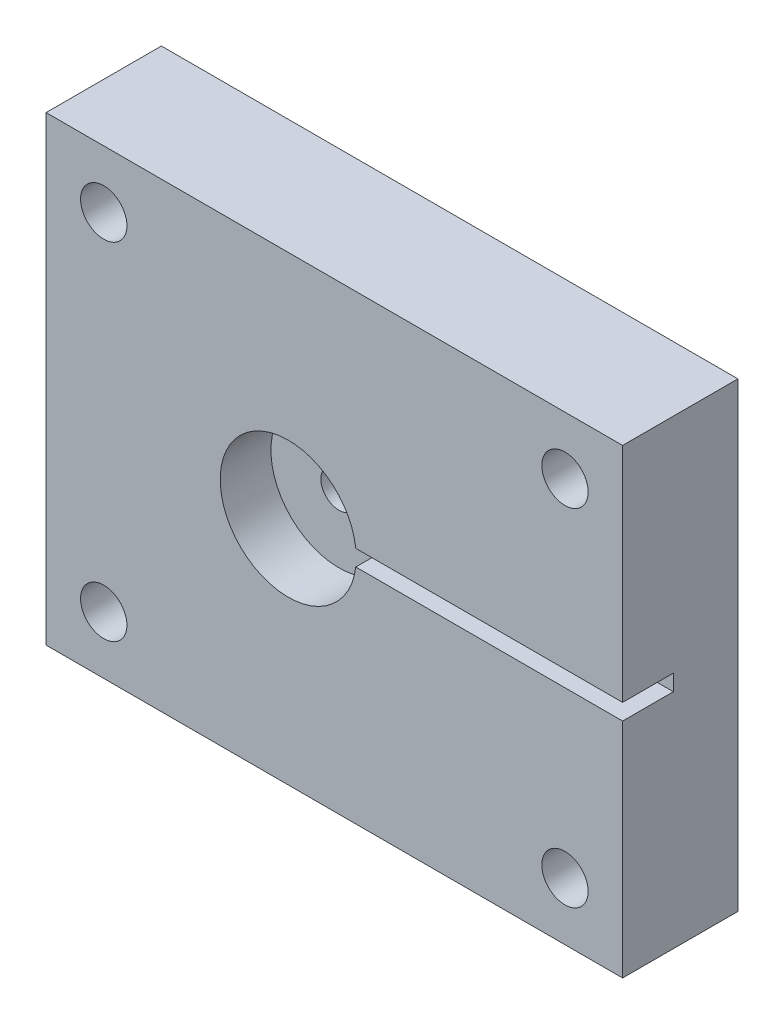
ISO-10303-21;
HEADER;
FILE_DESCRIPTION(('STEP AP214'),'2;1');
FILE_NAME('part.step','',(''),(''),'','','');
FILE_SCHEMA(('AUTOMOTIVE_DESIGN { 1 0 10303 214 1 1 1 1 }'));
ENDSEC;
DATA;
#1=APPLICATION_CONTEXT('core data for automotive mechanical design processes');
#2=APPLICATION_PROTOCOL_DEFINITION('international standard','automotive_design',2000,#1);
#3=PRODUCT_CONTEXT('',#1,'mechanical');
#4=PRODUCT('Part','Part','',(#3));
#5=PRODUCT_RELATED_PRODUCT_CATEGORY('part','',(#4));
#6=PRODUCT_DEFINITION_FORMATION('','',#4);
#7=PRODUCT_DEFINITION_CONTEXT('part definition',#1,'design');
#8=PRODUCT_DEFINITION('design','',#6,#7);
#9=PRODUCT_DEFINITION_SHAPE('','',#8);
#10=(LENGTH_UNIT() NAMED_UNIT(*) SI_UNIT(.MILLI.,.METRE.));
#11=(NAMED_UNIT(*) PLANE_ANGLE_UNIT() SI_UNIT($,.RADIAN.));
#12=(NAMED_UNIT(*) SI_UNIT($,.STERADIAN.) SOLID_ANGLE_UNIT());
#13=UNCERTAINTY_MEASURE_WITH_UNIT(LENGTH_MEASURE(1.E-05),#10,'distance_accuracy_value','');
#14=(GEOMETRIC_REPRESENTATION_CONTEXT(3) GLOBAL_UNCERTAINTY_ASSIGNED_CONTEXT((#13)) GLOBAL_UNIT_ASSIGNED_CONTEXT((#10,
#11,#12)) REPRESENTATION_CONTEXT('',''));
#15=CARTESIAN_POINT('',(0.,0.,0.));
#16=DIRECTION('',(0.,0.,1.));
#17=DIRECTION('',(1.,0.,0.));
#18=AXIS2_PLACEMENT_3D('',#15,#16,#17);
#19=CARTESIAN_POINT('',(-5.08,0.,-4.8768));
#20=DIRECTION('',(0.,0.,1.));
#21=DIRECTION('',(1.,0.,0.));
#22=AXIS2_PLACEMENT_3D('',#19,#20,#21);
#23=CYLINDRICAL_SURFACE('',#22,1.9939);
#24=CARTESIAN_POINT('',(-5.08,0.,7.112));
#25=DIRECTION('',(0.,0.,1.));
#26=DIRECTION('',(1.,0.,0.));
#27=AXIS2_PLACEMENT_3D('',#24,#25,#26);
#28=CIRCLE('',#27,1.9939);
#29=CARTESIAN_POINT('',(-3.0861,0.,7.112));
#30=VERTEX_POINT('',#29);
#31=EDGE_CURVE('E167',#30,#30,#28,.T.);
#32=ORIENTED_EDGE('',*,*,#31,.T.);
#33=EDGE_LOOP('',(#32));
#34=FACE_BOUND('',#33,.T.);
#35=CARTESIAN_POINT('',(-5.08,0.,4.572));
#36=DIRECTION('',(0.,0.,-1.));
#37=DIRECTION('',(-1.,0.,0.));
#38=AXIS2_PLACEMENT_3D('',#35,#36,#37);
#39=CIRCLE('',#38,1.9939);
#40=CARTESIAN_POINT('',(-7.0739,0.,4.572));
#41=VERTEX_POINT('',#40);
#42=EDGE_CURVE('E38',#41,#41,#39,.F.);
#43=ORIENTED_EDGE('',*,*,#42,.F.);
#44=EDGE_LOOP('',(#43));
#45=FACE_BOUND('',#44,.T.);
#46=ADVANCED_FACE('F34',(#34,#45),#23,.F.);
#47=CARTESIAN_POINT('',(31.75,25.4,12.7));
#48=DIRECTION('',(-1.,0.,0.));
#49=DIRECTION('',(0.,-1.,0.));
#50=AXIS2_PLACEMENT_3D('',#47,#48,#49);
#51=PLANE('',#50);
#52=DIRECTION('',(0.,1.,0.));
#53=VECTOR('',#52,1.);
#54=CARTESIAN_POINT('',(31.75,0.88900000000001,7.112));
#55=LINE('',#54,#53);
#56=CARTESIAN_POINT('',(31.75,-0.88899999999999,7.112));
#57=VERTEX_POINT('',#56);
#58=CARTESIAN_POINT('',(31.75,0.88900000000001,7.112));
#59=VERTEX_POINT('',#58);
#60=EDGE_CURVE('E114',#57,#59,#55,.T.);
#61=ORIENTED_EDGE('',*,*,#60,.F.);
#62=DIRECTION('',(0.,0.,1.));
#63=VECTOR('',#62,1.);
#64=CARTESIAN_POINT('',(31.75,-0.88899999999999,-24.6877450304244));
#65=LINE('',#64,#63);
#66=CARTESIAN_POINT('',(31.75,-0.88899999999999,12.7));
#67=VERTEX_POINT('',#66);
#68=EDGE_CURVE('E119',#57,#67,#65,.T.);
#69=ORIENTED_EDGE('',*,*,#68,.T.);
#70=DIRECTION('',(0.,1.,0.));
#71=VECTOR('',#70,1.);
#72=CARTESIAN_POINT('',(31.75,25.4,12.7));
#73=LINE('',#72,#71);
#74=CARTESIAN_POINT('',(31.75,-25.4,12.7));
#75=VERTEX_POINT('',#74);
#76=EDGE_CURVE('E139',#75,#67,#73,.T.);
#77=ORIENTED_EDGE('',*,*,#76,.F.);
#78=DIRECTION('',(0.,0.,-1.));
#79=VECTOR('',#78,1.);
#80=CARTESIAN_POINT('',(31.75,-25.4,12.7));
#81=LINE('',#80,#79);
#82=CARTESIAN_POINT('',(31.75,-25.4,0.));
#83=VERTEX_POINT('',#82);
#84=EDGE_CURVE('E146',#75,#83,#81,.T.);
#85=ORIENTED_EDGE('',*,*,#84,.T.);
#86=DIRECTION('',(0.,1.,0.));
#87=VECTOR('',#86,1.);
#88=CARTESIAN_POINT('',(31.75,25.4,0.));
#89=LINE('',#88,#87);
#90=CARTESIAN_POINT('',(31.75,25.4,0.));
#91=VERTEX_POINT('',#90);
#92=EDGE_CURVE('E138',#83,#91,#89,.T.);
#93=ORIENTED_EDGE('',*,*,#92,.T.);
#94=DIRECTION('',(0.,0.,-1.));
#95=VECTOR('',#94,1.);
#96=CARTESIAN_POINT('',(31.75,25.4,12.7));
#97=LINE('',#96,#95);
#98=CARTESIAN_POINT('',(31.75,25.4,12.7));
#99=VERTEX_POINT('',#98);
#100=EDGE_CURVE('E160',#99,#91,#97,.T.);
#101=ORIENTED_EDGE('',*,*,#100,.F.);
#102=CARTESIAN_POINT('',(31.75,0.88900000000001,12.7));
#103=VERTEX_POINT('',#102);
#104=EDGE_CURVE('E86',#103,#99,#73,.T.);
#105=ORIENTED_EDGE('',*,*,#104,.F.);
#106=DIRECTION('',(0.,0.,1.));
#107=VECTOR('',#106,1.);
#108=CARTESIAN_POINT('',(31.75,0.88900000000001,-24.6877450304244));
#109=LINE('',#108,#107);
#110=EDGE_CURVE('E128',#59,#103,#109,.T.);
#111=ORIENTED_EDGE('',*,*,#110,.F.);
#112=EDGE_LOOP('',(#61,#69,#77,#85,#93,#101,#105,#111));
#113=FACE_BOUND('',#112,.T.);
#114=ADVANCED_FACE('F36',(#113),#51,.F.);
#115=CARTESIAN_POINT('',(-31.75,25.4,12.7));
#116=DIRECTION('',(0.,-1.,0.));
#117=DIRECTION('',(0.,0.,-1.));
#118=AXIS2_PLACEMENT_3D('',#115,#116,#117);
#119=PLANE('',#118);
#120=DIRECTION('',(-1.,0.,0.));
#121=VECTOR('',#120,1.);
#122=CARTESIAN_POINT('',(-31.75,25.4,0.));
#123=LINE('',#122,#121);
#124=CARTESIAN_POINT('',(-31.75,25.4,0.));
#125=VERTEX_POINT('',#124);
#126=EDGE_CURVE('E149',#91,#125,#123,.T.);
#127=ORIENTED_EDGE('',*,*,#126,.T.);
#128=DIRECTION('',(0.,0.,-1.));
#129=VECTOR('',#128,1.);
#130=CARTESIAN_POINT('',(-31.75,25.4,12.7));
#131=LINE('',#130,#129);
#132=CARTESIAN_POINT('',(-31.75,25.4,12.7));
#133=VERTEX_POINT('',#132);
#134=EDGE_CURVE('E157',#133,#125,#131,.T.);
#135=ORIENTED_EDGE('',*,*,#134,.F.);
#136=DIRECTION('',(-1.,0.,0.));
#137=VECTOR('',#136,1.);
#138=CARTESIAN_POINT('',(-31.75,25.4,12.7));
#139=LINE('',#138,#137);
#140=EDGE_CURVE('E141',#99,#133,#139,.T.);
#141=ORIENTED_EDGE('',*,*,#140,.F.);
#142=ORIENTED_EDGE('',*,*,#100,.T.);
#143=EDGE_LOOP('',(#127,#135,#141,#142));
#144=FACE_BOUND('',#143,.T.);
#145=ADVANCED_FACE('F229',(#144),#119,.F.);
#146=CARTESIAN_POINT('',(-31.75,25.4,12.7));
#147=DIRECTION('',(1.,0.,0.));
#148=DIRECTION('',(0.,1.,0.));
#149=AXIS2_PLACEMENT_3D('',#146,#147,#148);
#150=PLANE('',#149);
#151=DIRECTION('',(0.,-1.,0.));
#152=VECTOR('',#151,1.);
#153=CARTESIAN_POINT('',(-31.75,25.4,0.));
#154=LINE('',#153,#152);
#155=CARTESIAN_POINT('',(-31.75,-25.4,0.));
#156=VERTEX_POINT('',#155);
#157=EDGE_CURVE('E151',#125,#156,#154,.T.);
#158=ORIENTED_EDGE('',*,*,#157,.T.);
#159=DIRECTION('',(0.,0.,-1.));
#160=VECTOR('',#159,1.);
#161=CARTESIAN_POINT('',(-31.75,-25.4,12.7));
#162=LINE('',#161,#160);
#163=CARTESIAN_POINT('',(-31.75,-25.4,12.7));
#164=VERTEX_POINT('',#163);
#165=EDGE_CURVE('E155',#164,#156,#162,.T.);
#166=ORIENTED_EDGE('',*,*,#165,.F.);
#167=DIRECTION('',(0.,-1.,0.));
#168=VECTOR('',#167,1.);
#169=CARTESIAN_POINT('',(-31.75,25.4,12.7));
#170=LINE('',#169,#168);
#171=EDGE_CURVE('E143',#133,#164,#170,.T.);
#172=ORIENTED_EDGE('',*,*,#171,.F.);
#173=ORIENTED_EDGE('',*,*,#134,.T.);
#174=EDGE_LOOP('',(#158,#166,#172,#173));
#175=FACE_BOUND('',#174,.T.);
#176=ADVANCED_FACE('F226',(#175),#150,.F.);
#177=CARTESIAN_POINT('',(-31.75,-25.4,12.7));
#178=DIRECTION('',(0.,1.,0.));
#179=DIRECTION('',(0.,0.,1.));
#180=AXIS2_PLACEMENT_3D('',#177,#178,#179);
#181=PLANE('',#180);
#182=DIRECTION('',(1.,0.,0.));
#183=VECTOR('',#182,1.);
#184=CARTESIAN_POINT('',(-31.75,-25.4,0.));
#185=LINE('',#184,#183);
#186=EDGE_CURVE('E80',#156,#83,#185,.T.);
#187=ORIENTED_EDGE('',*,*,#186,.T.);
#188=ORIENTED_EDGE('',*,*,#84,.F.);
#189=DIRECTION('',(1.,0.,0.));
#190=VECTOR('',#189,1.);
#191=CARTESIAN_POINT('',(-31.75,-25.4,12.7));
#192=LINE('',#191,#190);
#193=EDGE_CURVE('E59',#164,#75,#192,.T.);
#194=ORIENTED_EDGE('',*,*,#193,.F.);
#195=ORIENTED_EDGE('',*,*,#165,.T.);
#196=EDGE_LOOP('',(#187,#188,#194,#195));
#197=FACE_BOUND('',#196,.T.);
#198=ADVANCED_FACE('F222',(#197),#181,.F.);
#199=CARTESIAN_POINT('',(0.,0.,12.7));
#200=DIRECTION('',(0.,0.,1.));
#201=DIRECTION('',(1.,0.,0.));
#202=AXIS2_PLACEMENT_3D('',#199,#200,#201);
#203=PLANE('',#202);
#204=CARTESIAN_POINT('',(-25.4,-19.05,12.7));
#205=DIRECTION('',(0.,0.,-1.));
#206=DIRECTION('',(1.,0.,0.));
#207=AXIS2_PLACEMENT_3D('',#204,#205,#206);
#208=CIRCLE('',#207,2.5527);
#209=CARTESIAN_POINT('',(-22.8473,-19.05,12.7));
#210=VERTEX_POINT('',#209);
#211=EDGE_CURVE('E198',#210,#210,#208,.T.);
#212=ORIENTED_EDGE('',*,*,#211,.T.);
#213=EDGE_LOOP('',(#212));
#214=FACE_BOUND('',#213,.T.);
#215=CARTESIAN_POINT('',(25.4,-19.05,12.7));
#216=DIRECTION('',(0.,0.,1.));
#217=DIRECTION('',(-1.,0.,0.));
#218=AXIS2_PLACEMENT_3D('',#215,#216,#217);
#219=CIRCLE('',#218,2.5527);
#220=CARTESIAN_POINT('',(22.8473,-19.05,12.7));
#221=VERTEX_POINT('',#220);
#222=EDGE_CURVE('E192',#221,#221,#219,.T.);
#223=ORIENTED_EDGE('',*,*,#222,.F.);
#224=EDGE_LOOP('',(#223));
#225=FACE_BOUND('',#224,.T.);
#226=CARTESIAN_POINT('',(25.4,19.05,12.7));
#227=DIRECTION('',(0.,0.,-1.));
#228=DIRECTION('',(-1.,0.,0.));
#229=AXIS2_PLACEMENT_3D('',#226,#227,#228);
#230=CIRCLE('',#229,2.5527);
#231=CARTESIAN_POINT('',(22.8473,19.05,12.7));
#232=VERTEX_POINT('',#231);
#233=EDGE_CURVE('E186',#232,#232,#230,.T.);
#234=ORIENTED_EDGE('',*,*,#233,.T.);
#235=EDGE_LOOP('',(#234));
#236=FACE_BOUND('',#235,.T.);
#237=CARTESIAN_POINT('',(-25.4,19.05,12.7));
#238=DIRECTION('',(0.,0.,1.));
#239=DIRECTION('',(1.,0.,0.));
#240=AXIS2_PLACEMENT_3D('',#237,#238,#239);
#241=CIRCLE('',#240,2.5527);
#242=CARTESIAN_POINT('',(-22.8473,19.05,12.7));
#243=VERTEX_POINT('',#242);
#244=EDGE_CURVE('E180',#243,#243,#241,.T.);
#245=ORIENTED_EDGE('',*,*,#244,.F.);
#246=EDGE_LOOP('',(#245));
#247=FACE_BOUND('',#246,.T.);
#248=DIRECTION('',(1.,0.,0.));
#249=VECTOR('',#248,1.);
#250=CARTESIAN_POINT('',(0.,-0.888999999999994,12.7));
#251=LINE('',#250,#249);
#252=CARTESIAN_POINT('',(2.36007580606542,-0.888999999999994,12.7));
#253=VERTEX_POINT('',#252);
#254=EDGE_CURVE('E124',#253,#67,#251,.T.);
#255=ORIENTED_EDGE('',*,*,#254,.F.);
#256=CARTESIAN_POINT('',(-5.08,0.,12.7));
#257=DIRECTION('',(0.,0.,1.));
#258=DIRECTION('',(1.,0.,0.));
#259=AXIS2_PLACEMENT_3D('',#256,#257,#258);
#260=CIRCLE('',#259,7.493);
#261=CARTESIAN_POINT('',(2.36007580606542,0.888999999999996,12.7));
#262=VERTEX_POINT('',#261);
#263=EDGE_CURVE('E134',#262,#253,#260,.T.);
#264=ORIENTED_EDGE('',*,*,#263,.F.);
#265=DIRECTION('',(-1.,0.,0.));
#266=VECTOR('',#265,1.);
#267=CARTESIAN_POINT('',(0.,0.888999999999994,12.7));
#268=LINE('',#267,#266);
#269=EDGE_CURVE('E50',#103,#262,#268,.T.);
#270=ORIENTED_EDGE('',*,*,#269,.F.);
#271=ORIENTED_EDGE('',*,*,#104,.T.);
#272=ORIENTED_EDGE('',*,*,#140,.T.);
#273=ORIENTED_EDGE('',*,*,#171,.T.);
#274=ORIENTED_EDGE('',*,*,#193,.T.);
#275=ORIENTED_EDGE('',*,*,#76,.T.);
#276=EDGE_LOOP('',(#255,#264,#270,#271,#272,#273,#274,#275));
#277=FACE_BOUND('',#276,.T.);
#278=ADVANCED_FACE('F166',(#214,#225,#236,#247,#277),#203,.T.);
#279=CARTESIAN_POINT('',(0.,0.,0.));
#280=DIRECTION('',(0.,0.,1.));
#281=DIRECTION('',(1.,0.,0.));
#282=AXIS2_PLACEMENT_3D('',#279,#280,#281);
#283=PLANE('',#282);
#284=CARTESIAN_POINT('',(-25.4,-19.05,0.));
#285=DIRECTION('',(0.,0.,-1.));
#286=DIRECTION('',(1.,0.,0.));
#287=AXIS2_PLACEMENT_3D('',#284,#285,#286);
#288=CIRCLE('',#287,2.5527);
#289=CARTESIAN_POINT('',(-22.8473,-19.05,0.));
#290=VERTEX_POINT('',#289);
#291=EDGE_CURVE('E195',#290,#290,#288,.T.);
#292=ORIENTED_EDGE('',*,*,#291,.F.);
#293=EDGE_LOOP('',(#292));
#294=FACE_BOUND('',#293,.T.);
#295=CARTESIAN_POINT('',(25.4,-19.05,0.));
#296=DIRECTION('',(0.,0.,1.));
#297=DIRECTION('',(-1.,0.,0.));
#298=AXIS2_PLACEMENT_3D('',#295,#296,#297);
#299=CIRCLE('',#298,2.5527);
#300=CARTESIAN_POINT('',(22.8473,-19.05,0.));
#301=VERTEX_POINT('',#300);
#302=EDGE_CURVE('E189',#301,#301,#299,.T.);
#303=ORIENTED_EDGE('',*,*,#302,.T.);
#304=EDGE_LOOP('',(#303));
#305=FACE_BOUND('',#304,.T.);
#306=CARTESIAN_POINT('',(25.4,19.05,0.));
#307=DIRECTION('',(0.,0.,-1.));
#308=DIRECTION('',(-1.,0.,0.));
#309=AXIS2_PLACEMENT_3D('',#306,#307,#308);
#310=CIRCLE('',#309,2.5527);
#311=CARTESIAN_POINT('',(22.8473,19.05,0.));
#312=VERTEX_POINT('',#311);
#313=EDGE_CURVE('E183',#312,#312,#310,.T.);
#314=ORIENTED_EDGE('',*,*,#313,.F.);
#315=EDGE_LOOP('',(#314));
#316=FACE_BOUND('',#315,.T.);
#317=CARTESIAN_POINT('',(-25.4,19.05,0.));
#318=DIRECTION('',(0.,0.,1.));
#319=DIRECTION('',(1.,0.,0.));
#320=AXIS2_PLACEMENT_3D('',#317,#318,#319);
#321=CIRCLE('',#320,2.5527);
#322=CARTESIAN_POINT('',(-22.8473,19.05,0.));
#323=VERTEX_POINT('',#322);
#324=EDGE_CURVE('E179',#323,#323,#321,.T.);
#325=ORIENTED_EDGE('',*,*,#324,.T.);
#326=EDGE_LOOP('',(#325));
#327=FACE_BOUND('',#326,.T.);
#328=CARTESIAN_POINT('',(-5.08,0.,0.));
#329=DIRECTION('',(0.,0.,-1.));
#330=DIRECTION('',(-1.,0.,0.));
#331=AXIS2_PLACEMENT_3D('',#328,#329,#330);
#332=CIRCLE('',#331,7.493);
#333=CARTESIAN_POINT('',(-12.573,0.,0.));
#334=VERTEX_POINT('',#333);
#335=EDGE_CURVE('E176',#334,#334,#332,.T.);
#336=ORIENTED_EDGE('',*,*,#335,.F.);
#337=EDGE_LOOP('',(#336));
#338=FACE_BOUND('',#337,.T.);
#339=ORIENTED_EDGE('',*,*,#92,.F.);
#340=ORIENTED_EDGE('',*,*,#186,.F.);
#341=ORIENTED_EDGE('',*,*,#157,.F.);
#342=ORIENTED_EDGE('',*,*,#126,.F.);
#343=EDGE_LOOP('',(#339,#340,#341,#342));
#344=FACE_BOUND('',#343,.T.);
#345=ADVANCED_FACE('F207',(#294,#305,#316,#327,#338,#344),#283,.F.);
#346=CARTESIAN_POINT('',(0.,0.,7.112));
#347=DIRECTION('',(0.,0.,-1.));
#348=DIRECTION('',(-1.,0.,0.));
#349=AXIS2_PLACEMENT_3D('',#346,#347,#348);
#350=PLANE('',#349);
#351=ORIENTED_EDGE('',*,*,#31,.F.);
#352=EDGE_LOOP('',(#351));
#353=FACE_BOUND('',#352,.T.);
#354=DIRECTION('',(-1.,0.,0.));
#355=VECTOR('',#354,1.);
#356=CARTESIAN_POINT('',(0.,0.888999999999994,7.112));
#357=LINE('',#356,#355);
#358=CARTESIAN_POINT('',(2.36007580606542,0.888999999999995,7.112));
#359=VERTEX_POINT('',#358);
#360=EDGE_CURVE('E130',#59,#359,#357,.T.);
#361=ORIENTED_EDGE('',*,*,#360,.T.);
#362=CARTESIAN_POINT('',(-5.08,0.,7.112));
#363=DIRECTION('',(0.,0.,-1.));
#364=DIRECTION('',(-1.,0.,0.));
#365=AXIS2_PLACEMENT_3D('',#362,#363,#364);
#366=CIRCLE('',#365,7.493);
#367=CARTESIAN_POINT('',(2.36007580606542,-0.888999999999994,7.112));
#368=VERTEX_POINT('',#367);
#369=EDGE_CURVE('E117',#359,#368,#366,.F.);
#370=ORIENTED_EDGE('',*,*,#369,.T.);
#371=DIRECTION('',(1.,0.,0.));
#372=VECTOR('',#371,1.);
#373=CARTESIAN_POINT('',(0.,-0.888999999999994,7.112));
#374=LINE('',#373,#372);
#375=EDGE_CURVE('E109',#368,#57,#374,.T.);
#376=ORIENTED_EDGE('',*,*,#375,.T.);
#377=ORIENTED_EDGE('',*,*,#60,.T.);
#378=EDGE_LOOP('',(#361,#370,#376,#377));
#379=FACE_BOUND('',#378,.T.);
#380=ADVANCED_FACE('F112',(#353,#379),#350,.F.);
#381=CARTESIAN_POINT('',(-5.08,0.,-14.0814044457232));
#382=DIRECTION('',(0.,0.,1.));
#383=DIRECTION('',(1.,0.,0.));
#384=AXIS2_PLACEMENT_3D('',#381,#382,#383);
#385=CYLINDRICAL_SURFACE('',#384,7.493);
#386=ORIENTED_EDGE('',*,*,#263,.T.);
#387=DIRECTION('',(0.,0.,1.));
#388=VECTOR('',#387,1.);
#389=CARTESIAN_POINT('',(2.36007580606542,-0.888999999999994,-14.0814044457232));
#390=LINE('',#389,#388);
#391=EDGE_CURVE('E11',#253,#368,#390,.F.);
#392=ORIENTED_EDGE('',*,*,#391,.T.);
#393=ORIENTED_EDGE('',*,*,#369,.F.);
#394=DIRECTION('',(0.,0.,1.));
#395=VECTOR('',#394,1.);
#396=CARTESIAN_POINT('',(2.36007580606542,0.888999999999995,-14.0814044457232));
#397=LINE('',#396,#395);
#398=EDGE_CURVE('E43',#359,#262,#397,.T.);
#399=ORIENTED_EDGE('',*,*,#398,.T.);
#400=EDGE_LOOP('',(#386,#392,#393,#399));
#401=FACE_BOUND('',#400,.T.);
#402=ADVANCED_FACE('F165',(#401),#385,.F.);
#403=CARTESIAN_POINT('',(0.,-0.888999999999994,-24.6877450304244));
#404=DIRECTION('',(0.,-1.,0.));
#405=DIRECTION('',(1.,0.,0.));
#406=AXIS2_PLACEMENT_3D('',#403,#404,#405);
#407=PLANE('',#406);
#408=ORIENTED_EDGE('',*,*,#254,.T.);
#409=ORIENTED_EDGE('',*,*,#68,.F.);
#410=ORIENTED_EDGE('',*,*,#375,.F.);
#411=ORIENTED_EDGE('',*,*,#391,.F.);
#412=EDGE_LOOP('',(#408,#409,#410,#411));
#413=FACE_BOUND('',#412,.T.);
#414=ADVANCED_FACE('F122',(#413),#407,.F.);
#415=CARTESIAN_POINT('',(0.,0.888999999999994,-24.6877450304244));
#416=DIRECTION('',(0.,1.,0.));
#417=DIRECTION('',(-1.,0.,0.));
#418=AXIS2_PLACEMENT_3D('',#415,#416,#417);
#419=PLANE('',#418);
#420=ORIENTED_EDGE('',*,*,#360,.F.);
#421=ORIENTED_EDGE('',*,*,#110,.T.);
#422=ORIENTED_EDGE('',*,*,#269,.T.);
#423=ORIENTED_EDGE('',*,*,#398,.F.);
#424=EDGE_LOOP('',(#420,#421,#422,#423));
#425=FACE_BOUND('',#424,.T.);
#426=ADVANCED_FACE('F246',(#425),#419,.F.);
#427=CARTESIAN_POINT('',(0.,0.,4.572));
#428=DIRECTION('',(0.,0.,-1.));
#429=DIRECTION('',(-1.,0.,0.));
#430=AXIS2_PLACEMENT_3D('',#427,#428,#429);
#431=PLANE('',#430);
#432=CARTESIAN_POINT('',(-5.08,0.,4.572));
#433=DIRECTION('',(0.,0.,-1.));
#434=DIRECTION('',(-1.,0.,0.));
#435=AXIS2_PLACEMENT_3D('',#432,#433,#434);
#436=CIRCLE('',#435,7.493);
#437=CARTESIAN_POINT('',(-12.573,0.,4.572));
#438=VERTEX_POINT('',#437);
#439=EDGE_CURVE('E173',#438,#438,#436,.F.);
#440=ORIENTED_EDGE('',*,*,#439,.F.);
#441=EDGE_LOOP('',(#440));
#442=FACE_BOUND('',#441,.T.);
#443=ORIENTED_EDGE('',*,*,#42,.T.);
#444=EDGE_LOOP('',(#443));
#445=FACE_BOUND('',#444,.T.);
#446=ADVANCED_FACE('F249',(#442,#445),#431,.T.);
#447=CARTESIAN_POINT('',(-5.08,0.,25.7654044457232));
#448=DIRECTION('',(0.,0.,-1.));
#449=DIRECTION('',(-1.,0.,0.));
#450=AXIS2_PLACEMENT_3D('',#447,#448,#449);
#451=CYLINDRICAL_SURFACE('',#450,7.493);
#452=ORIENTED_EDGE('',*,*,#439,.T.);
#453=EDGE_LOOP('',(#452));
#454=FACE_BOUND('',#453,.T.);
#455=ORIENTED_EDGE('',*,*,#335,.T.);
#456=EDGE_LOOP('',(#455));
#457=FACE_BOUND('',#456,.T.);
#458=ADVANCED_FACE('F244',(#454,#457),#451,.F.);
#459=CARTESIAN_POINT('',(-25.4,19.05,0.));
#460=DIRECTION('',(0.,0.,1.));
#461=DIRECTION('',(1.,0.,0.));
#462=AXIS2_PLACEMENT_3D('',#459,#460,#461);
#463=CYLINDRICAL_SURFACE('',#462,2.5527);
#464=ORIENTED_EDGE('',*,*,#324,.F.);
#465=EDGE_LOOP('',(#464));
#466=FACE_BOUND('',#465,.T.);
#467=ORIENTED_EDGE('',*,*,#244,.T.);
#468=EDGE_LOOP('',(#467));
#469=FACE_BOUND('',#468,.T.);
#470=ADVANCED_FACE('F304',(#466,#469),#463,.F.);
#471=CARTESIAN_POINT('',(25.4,19.05,0.));
#472=DIRECTION('',(0.,0.,1.));
#473=DIRECTION('',(1.,0.,0.));
#474=AXIS2_PLACEMENT_3D('',#471,#472,#473);
#475=CYLINDRICAL_SURFACE('',#474,2.5527);
#476=ORIENTED_EDGE('',*,*,#313,.T.);
#477=EDGE_LOOP('',(#476));
#478=FACE_BOUND('',#477,.T.);
#479=ORIENTED_EDGE('',*,*,#233,.F.);
#480=EDGE_LOOP('',(#479));
#481=FACE_BOUND('',#480,.T.);
#482=ADVANCED_FACE('F311',(#478,#481),#475,.F.);
#483=CARTESIAN_POINT('',(25.4,-19.05,0.));
#484=DIRECTION('',(0.,0.,1.));
#485=DIRECTION('',(1.,0.,0.));
#486=AXIS2_PLACEMENT_3D('',#483,#484,#485);
#487=CYLINDRICAL_SURFACE('',#486,2.5527);
#488=ORIENTED_EDGE('',*,*,#302,.F.);
#489=EDGE_LOOP('',(#488));
#490=FACE_BOUND('',#489,.T.);
#491=ORIENTED_EDGE('',*,*,#222,.T.);
#492=EDGE_LOOP('',(#491));
#493=FACE_BOUND('',#492,.T.);
#494=ADVANCED_FACE('F318',(#490,#493),#487,.F.);
#495=CARTESIAN_POINT('',(-25.4,-19.05,0.));
#496=DIRECTION('',(0.,0.,1.));
#497=DIRECTION('',(1.,0.,0.));
#498=AXIS2_PLACEMENT_3D('',#495,#496,#497);
#499=CYLINDRICAL_SURFACE('',#498,2.5527);
#500=ORIENTED_EDGE('',*,*,#291,.T.);
#501=EDGE_LOOP('',(#500));
#502=FACE_BOUND('',#501,.T.);
#503=ORIENTED_EDGE('',*,*,#211,.F.);
#504=EDGE_LOOP('',(#503));
#505=FACE_BOUND('',#504,.T.);
#506=ADVANCED_FACE('F204',(#502,#505),#499,.F.);
#507=CLOSED_SHELL('',(#46,#114,#145,#176,#198,#278,#345,#380,#402,#414,#426,#446,#458,#470,#482,
#494,#506));
#508=MANIFOLD_SOLID_BREP('B2',#507);
#509=ADVANCED_BREP_SHAPE_REPRESENTATION('',(#18,#508),#14);
#510=SHAPE_DEFINITION_REPRESENTATION(#9,#509);
ENDSEC;
END-ISO-10303-21;
